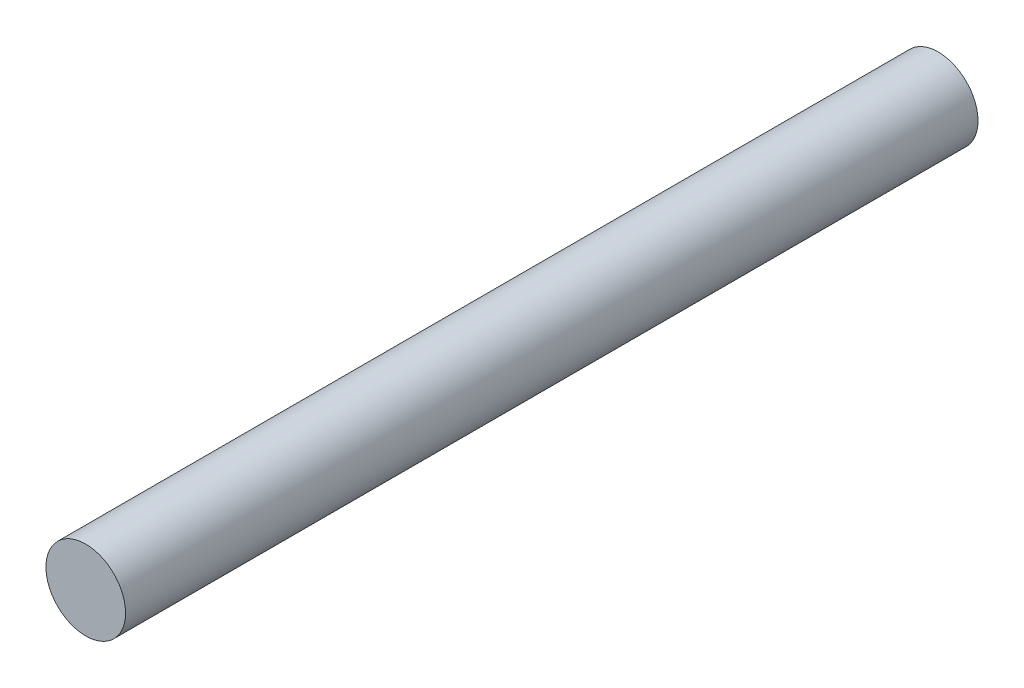
ISO-10303-21;
HEADER;
FILE_DESCRIPTION(('STEP AP214'),'2;1');
FILE_NAME('part.step','',(''),(''),'','','');
FILE_SCHEMA(('AUTOMOTIVE_DESIGN { 1 0 10303 214 1 1 1 1 }'));
ENDSEC;
DATA;
#1=APPLICATION_CONTEXT('core data for automotive mechanical design processes');
#2=APPLICATION_PROTOCOL_DEFINITION('international standard','automotive_design',2000,#1);
#3=PRODUCT_CONTEXT('',#1,'mechanical');
#4=PRODUCT('Part','Part','',(#3));
#5=PRODUCT_RELATED_PRODUCT_CATEGORY('part','',(#4));
#6=PRODUCT_DEFINITION_FORMATION('','',#4);
#7=PRODUCT_DEFINITION_CONTEXT('part definition',#1,'design');
#8=PRODUCT_DEFINITION('design','',#6,#7);
#9=PRODUCT_DEFINITION_SHAPE('','',#8);
#10=(LENGTH_UNIT() NAMED_UNIT(*) SI_UNIT(.MILLI.,.METRE.));
#11=(NAMED_UNIT(*) PLANE_ANGLE_UNIT() SI_UNIT($,.RADIAN.));
#12=(NAMED_UNIT(*) SI_UNIT($,.STERADIAN.) SOLID_ANGLE_UNIT());
#13=UNCERTAINTY_MEASURE_WITH_UNIT(LENGTH_MEASURE(1.E-05),#10,'distance_accuracy_value','');
#14=(GEOMETRIC_REPRESENTATION_CONTEXT(3) GLOBAL_UNCERTAINTY_ASSIGNED_CONTEXT((#13)) GLOBAL_UNIT_ASSIGNED_CONTEXT((#10,
#11,#12)) REPRESENTATION_CONTEXT('',''));
#15=CARTESIAN_POINT('',(0.,0.,0.));
#16=DIRECTION('',(0.,0.,1.));
#17=DIRECTION('',(1.,0.,0.));
#18=AXIS2_PLACEMENT_3D('',#15,#16,#17);
#19=CARTESIAN_POINT('',(-139.011827935995,-69.8299844098554,64.24));
#20=DIRECTION('',(0.,0.,-1.));
#21=DIRECTION('',(-1.,0.,0.));
#22=AXIS2_PLACEMENT_3D('',#19,#20,#21);
#23=CYLINDRICAL_SURFACE('',#22,2.99999999999999);
#24=CARTESIAN_POINT('',(-139.011827935995,-69.8299844098554,64.24));
#25=DIRECTION('',(0.,0.,1.));
#26=DIRECTION('',(1.,0.,0.));
#27=AXIS2_PLACEMENT_3D('',#24,#25,#26);
#28=CIRCLE('',#27,2.99999999999999);
#29=CARTESIAN_POINT('',(-136.011827935995,-69.8299844098554,64.24));
#30=VERTEX_POINT('',#29);
#31=EDGE_CURVE('E10',#30,#30,#28,.T.);
#32=ORIENTED_EDGE('',*,*,#31,.F.);
#33=EDGE_LOOP('',(#32));
#34=FACE_BOUND('',#33,.T.);
#35=CARTESIAN_POINT('',(-139.011827935995,-69.8299844098554,0.));
#36=DIRECTION('',(0.,0.,1.));
#37=DIRECTION('',(1.,0.,0.));
#38=AXIS2_PLACEMENT_3D('',#35,#36,#37);
#39=CIRCLE('',#38,2.99999999999999);
#40=CARTESIAN_POINT('',(-136.011827935995,-69.8299844098554,0.));
#41=VERTEX_POINT('',#40);
#42=EDGE_CURVE('E38',#41,#41,#39,.T.);
#43=ORIENTED_EDGE('',*,*,#42,.T.);
#44=EDGE_LOOP('',(#43));
#45=FACE_BOUND('',#44,.T.);
#46=ADVANCED_FACE('F35',(#34,#45),#23,.T.);
#47=CARTESIAN_POINT('',(-139.011827935995,-69.8299844098554,64.24));
#48=DIRECTION('',(0.,0.,1.));
#49=DIRECTION('',(1.,0.,0.));
#50=AXIS2_PLACEMENT_3D('',#47,#48,#49);
#51=PLANE('',#50);
#52=ORIENTED_EDGE('',*,*,#31,.T.);
#53=EDGE_LOOP('',(#52));
#54=FACE_BOUND('',#53,.T.);
#55=ADVANCED_FACE('F50',(#54),#51,.T.);
#56=CARTESIAN_POINT('',(-139.011827935995,-69.8299844098554,0.));
#57=DIRECTION('',(0.,0.,1.));
#58=DIRECTION('',(1.,0.,0.));
#59=AXIS2_PLACEMENT_3D('',#56,#57,#58);
#60=PLANE('',#59);
#61=ORIENTED_EDGE('',*,*,#42,.F.);
#62=EDGE_LOOP('',(#61));
#63=FACE_BOUND('',#62,.T.);
#64=ADVANCED_FACE('F48',(#63),#60,.F.);
#65=CLOSED_SHELL('',(#46,#55,#64));
#66=MANIFOLD_SOLID_BREP('B2',#65);
#67=ADVANCED_BREP_SHAPE_REPRESENTATION('',(#18,#66),#14);
#68=SHAPE_DEFINITION_REPRESENTATION(#9,#67);
ENDSEC;
END-ISO-10303-21;
